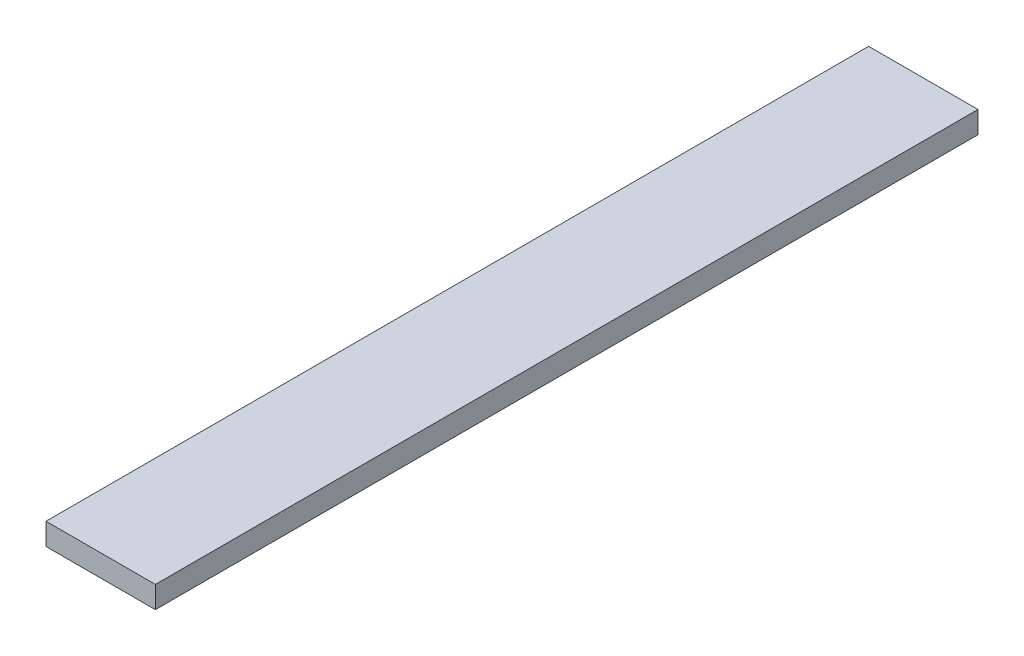
ISO-10303-21;
HEADER;
FILE_DESCRIPTION(('STEP AP214'),'2;1');
FILE_NAME('part.step','',(''),(''),'','','');
FILE_SCHEMA(('AUTOMOTIVE_DESIGN { 1 0 10303 214 1 1 1 1 }'));
ENDSEC;
DATA;
#1=APPLICATION_CONTEXT('core data for automotive mechanical design processes');
#2=APPLICATION_PROTOCOL_DEFINITION('international standard','automotive_design',2000,#1);
#3=PRODUCT_CONTEXT('',#1,'mechanical');
#4=PRODUCT('Part','Part','',(#3));
#5=PRODUCT_RELATED_PRODUCT_CATEGORY('part','',(#4));
#6=PRODUCT_DEFINITION_FORMATION('','',#4);
#7=PRODUCT_DEFINITION_CONTEXT('part definition',#1,'design');
#8=PRODUCT_DEFINITION('design','',#6,#7);
#9=PRODUCT_DEFINITION_SHAPE('','',#8);
#10=(LENGTH_UNIT() NAMED_UNIT(*) SI_UNIT(.MILLI.,.METRE.));
#11=(NAMED_UNIT(*) PLANE_ANGLE_UNIT() SI_UNIT($,.RADIAN.));
#12=(NAMED_UNIT(*) SI_UNIT($,.STERADIAN.) SOLID_ANGLE_UNIT());
#13=UNCERTAINTY_MEASURE_WITH_UNIT(LENGTH_MEASURE(1.E-05),#10,'distance_accuracy_value','');
#14=(GEOMETRIC_REPRESENTATION_CONTEXT(3) GLOBAL_UNCERTAINTY_ASSIGNED_CONTEXT((#13)) GLOBAL_UNIT_ASSIGNED_CONTEXT((#10,
#11,#12)) REPRESENTATION_CONTEXT('',''));
#15=CARTESIAN_POINT('',(0.,0.,0.));
#16=DIRECTION('',(0.,0.,1.));
#17=DIRECTION('',(1.,0.,0.));
#18=AXIS2_PLACEMENT_3D('',#15,#16,#17);
#19=CARTESIAN_POINT('',(0.,1.42999999999,0.));
#20=DIRECTION('',(0.,-1.,0.));
#21=DIRECTION('',(1.,0.,0.));
#22=AXIS2_PLACEMENT_3D('',#19,#20,#21);
#23=PLANE('',#22);
#24=DIRECTION('',(1.,0.,0.));
#25=VECTOR('',#24,1.);
#26=CARTESIAN_POINT('',(0.,1.42999999999,2.075));
#27=LINE('',#26,#25);
#28=CARTESIAN_POINT('',(-0.625,1.42999999999,2.075));
#29=VERTEX_POINT('',#28);
#30=CARTESIAN_POINT('',(-0.875,1.42999999999,2.075));
#31=VERTEX_POINT('',#30);
#32=EDGE_CURVE('E19',#29,#31,#27,.F.);
#33=ORIENTED_EDGE('',*,*,#32,.F.);
#34=DIRECTION('',(0.,0.,1.));
#35=VECTOR('',#34,1.);
#36=CARTESIAN_POINT('',(-0.625,1.42999999999,0.195));
#37=LINE('',#36,#35);
#38=CARTESIAN_POINT('',(-0.625,1.42999999999,0.195));
#39=VERTEX_POINT('',#38);
#40=EDGE_CURVE('E68',#29,#39,#37,.F.);
#41=ORIENTED_EDGE('',*,*,#40,.T.);
#42=DIRECTION('',(1.,0.,0.));
#43=VECTOR('',#42,1.);
#44=CARTESIAN_POINT('',(-0.875,1.42999999999,0.195));
#45=LINE('',#44,#43);
#46=CARTESIAN_POINT('',(-0.875,1.42999999999,0.195));
#47=VERTEX_POINT('',#46);
#48=EDGE_CURVE('E55',#39,#47,#45,.F.);
#49=ORIENTED_EDGE('',*,*,#48,.T.);
#50=DIRECTION('',(0.,0.,1.));
#51=VECTOR('',#50,1.);
#52=CARTESIAN_POINT('',(-0.875,1.42999999999,0.195));
#53=LINE('',#52,#51);
#54=EDGE_CURVE('E61',#47,#31,#53,.T.);
#55=ORIENTED_EDGE('',*,*,#54,.T.);
#56=EDGE_LOOP('',(#33,#41,#49,#55));
#57=FACE_BOUND('',#56,.T.);
#58=ADVANCED_FACE('F16',(#57),#23,.F.);
#59=CARTESIAN_POINT('',(-0.875,1.37999999999,0.195));
#60=DIRECTION('',(1.,0.,0.));
#61=DIRECTION('',(0.,1.,0.));
#62=AXIS2_PLACEMENT_3D('',#59,#60,#61);
#63=PLANE('',#62);
#64=DIRECTION('',(0.,1.,0.));
#65=VECTOR('',#64,1.);
#66=CARTESIAN_POINT('',(-0.875,1.37999999999,0.195));
#67=LINE('',#66,#65);
#68=CARTESIAN_POINT('',(-0.875,1.37999999999,0.195));
#69=VERTEX_POINT('',#68);
#70=EDGE_CURVE('E63',#47,#69,#67,.F.);
#71=ORIENTED_EDGE('',*,*,#70,.T.);
#72=DIRECTION('',(0.,0.,1.));
#73=VECTOR('',#72,1.);
#74=CARTESIAN_POINT('',(-0.875,1.37999999999,0.));
#75=LINE('',#74,#73);
#76=CARTESIAN_POINT('',(-0.875,1.37999999999,2.075));
#77=VERTEX_POINT('',#76);
#78=EDGE_CURVE('E82',#77,#69,#75,.F.);
#79=ORIENTED_EDGE('',*,*,#78,.F.);
#80=DIRECTION('',(0.,1.,0.));
#81=VECTOR('',#80,1.);
#82=CARTESIAN_POINT('',(-0.875,1.37999999999,2.075));
#83=LINE('',#82,#81);
#84=EDGE_CURVE('E66',#77,#31,#83,.T.);
#85=ORIENTED_EDGE('',*,*,#84,.T.);
#86=ORIENTED_EDGE('',*,*,#54,.F.);
#87=EDGE_LOOP('',(#71,#79,#85,#86));
#88=FACE_BOUND('',#87,.T.);
#89=ADVANCED_FACE('F62',(#88),#63,.F.);
#90=CARTESIAN_POINT('',(-0.875,1.37999999999,0.195));
#91=DIRECTION('',(0.,0.,1.));
#92=DIRECTION('',(1.,0.,0.));
#93=AXIS2_PLACEMENT_3D('',#90,#91,#92);
#94=PLANE('',#93);
#95=DIRECTION('',(0.,-1.,0.));
#96=VECTOR('',#95,1.);
#97=CARTESIAN_POINT('',(-0.625,1.37999999999,0.195));
#98=LINE('',#97,#96);
#99=CARTESIAN_POINT('',(-0.625,1.37999999999,0.195));
#100=VERTEX_POINT('',#99);
#101=EDGE_CURVE('E70',#39,#100,#98,.T.);
#102=ORIENTED_EDGE('',*,*,#101,.T.);
#103=DIRECTION('',(1.,0.,0.));
#104=VECTOR('',#103,1.);
#105=CARTESIAN_POINT('',(0.,1.37999999999,0.195));
#106=LINE('',#105,#104);
#107=EDGE_CURVE('E74',#69,#100,#106,.T.);
#108=ORIENTED_EDGE('',*,*,#107,.F.);
#109=ORIENTED_EDGE('',*,*,#70,.F.);
#110=ORIENTED_EDGE('',*,*,#48,.F.);
#111=EDGE_LOOP('',(#102,#108,#109,#110));
#112=FACE_BOUND('',#111,.T.);
#113=ADVANCED_FACE('F72',(#112),#94,.F.);
#114=CARTESIAN_POINT('',(-0.625,1.37999999999,0.195));
#115=DIRECTION('',(-1.,0.,0.));
#116=DIRECTION('',(0.,-1.,0.));
#117=AXIS2_PLACEMENT_3D('',#114,#115,#116);
#118=PLANE('',#117);
#119=DIRECTION('',(0.,1.,0.));
#120=VECTOR('',#119,1.);
#121=CARTESIAN_POINT('',(-0.625,1.37999999999,2.075));
#122=LINE('',#121,#120);
#123=CARTESIAN_POINT('',(-0.625,1.37999999999,2.075));
#124=VERTEX_POINT('',#123);
#125=EDGE_CURVE('E34',#29,#124,#122,.F.);
#126=ORIENTED_EDGE('',*,*,#125,.T.);
#127=DIRECTION('',(0.,0.,1.));
#128=VECTOR('',#127,1.);
#129=CARTESIAN_POINT('',(-0.625,1.37999999999,0.));
#130=LINE('',#129,#128);
#131=EDGE_CURVE('E25',#100,#124,#130,.T.);
#132=ORIENTED_EDGE('',*,*,#131,.F.);
#133=ORIENTED_EDGE('',*,*,#101,.F.);
#134=ORIENTED_EDGE('',*,*,#40,.F.);
#135=EDGE_LOOP('',(#126,#132,#133,#134));
#136=FACE_BOUND('',#135,.T.);
#137=ADVANCED_FACE('F88',(#136),#118,.F.);
#138=CARTESIAN_POINT('',(-0.875,1.37999999999,2.075));
#139=DIRECTION('',(0.,0.,-1.));
#140=DIRECTION('',(-1.,0.,0.));
#141=AXIS2_PLACEMENT_3D('',#138,#139,#140);
#142=PLANE('',#141);
#143=ORIENTED_EDGE('',*,*,#84,.F.);
#144=DIRECTION('',(1.,0.,0.));
#145=VECTOR('',#144,1.);
#146=CARTESIAN_POINT('',(0.,1.37999999999,2.075));
#147=LINE('',#146,#145);
#148=EDGE_CURVE('E11',#124,#77,#147,.F.);
#149=ORIENTED_EDGE('',*,*,#148,.F.);
#150=ORIENTED_EDGE('',*,*,#125,.F.);
#151=ORIENTED_EDGE('',*,*,#32,.T.);
#152=EDGE_LOOP('',(#143,#149,#150,#151));
#153=FACE_BOUND('',#152,.T.);
#154=ADVANCED_FACE('F90',(#153),#142,.F.);
#155=CARTESIAN_POINT('',(0.,1.37999999999,0.));
#156=DIRECTION('',(0.,-1.,0.));
#157=DIRECTION('',(1.,0.,0.));
#158=AXIS2_PLACEMENT_3D('',#155,#156,#157);
#159=PLANE('',#158);
#160=ORIENTED_EDGE('',*,*,#131,.T.);
#161=ORIENTED_EDGE('',*,*,#148,.T.);
#162=ORIENTED_EDGE('',*,*,#78,.T.);
#163=ORIENTED_EDGE('',*,*,#107,.T.);
#164=EDGE_LOOP('',(#160,#161,#162,#163));
#165=FACE_BOUND('',#164,.T.);
#166=ADVANCED_FACE('F87',(#165),#159,.T.);
#167=CLOSED_SHELL('',(#58,#89,#113,#137,#154,#166));
#168=MANIFOLD_SOLID_BREP('B1',#167);
#169=ADVANCED_BREP_SHAPE_REPRESENTATION('',(#18,#168),#14);
#170=SHAPE_DEFINITION_REPRESENTATION(#9,#169);
ENDSEC;
END-ISO-10303-21;
